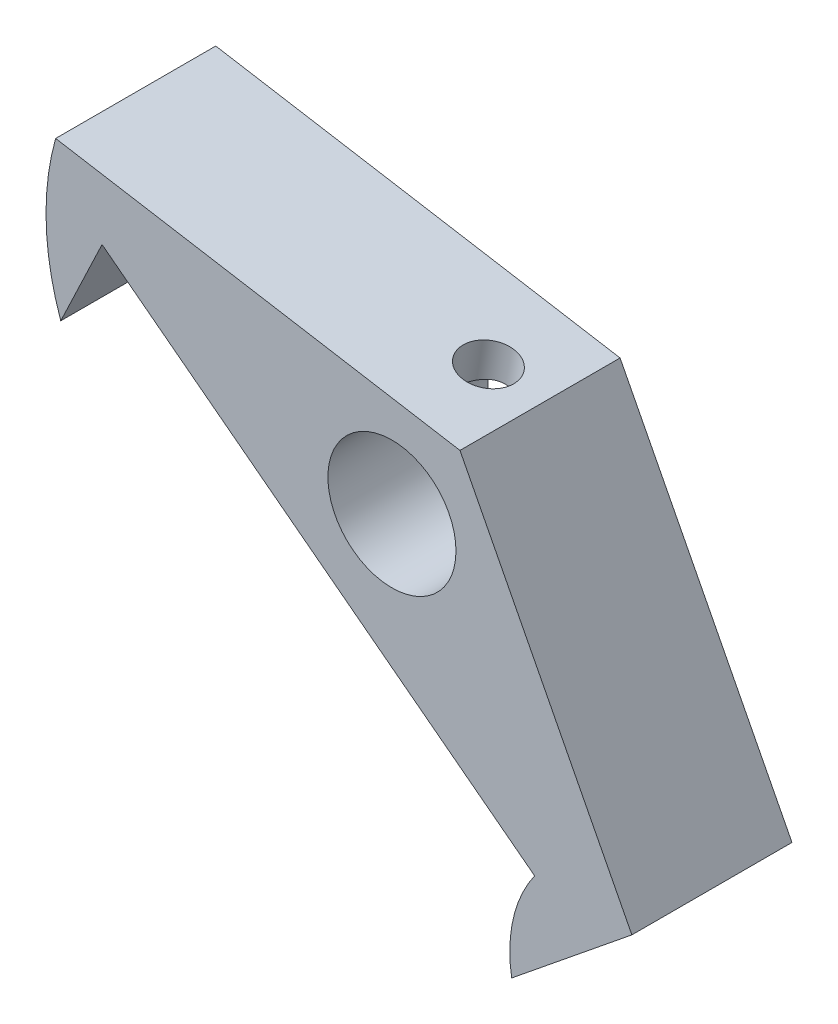
ISO-10303-21;
HEADER;
FILE_DESCRIPTION(('STEP AP214'),'2;1');
FILE_NAME('part.step','',(''),(''),'','','');
FILE_SCHEMA(('AUTOMOTIVE_DESIGN { 1 0 10303 214 1 1 1 1 }'));
ENDSEC;
DATA;
#1=APPLICATION_CONTEXT('core data for automotive mechanical design processes');
#2=APPLICATION_PROTOCOL_DEFINITION('international standard','automotive_design',2000,#1);
#3=PRODUCT_CONTEXT('',#1,'mechanical');
#4=PRODUCT('Part','Part','',(#3));
#5=PRODUCT_RELATED_PRODUCT_CATEGORY('part','',(#4));
#6=PRODUCT_DEFINITION_FORMATION('','',#4);
#7=PRODUCT_DEFINITION_CONTEXT('part definition',#1,'design');
#8=PRODUCT_DEFINITION('design','',#6,#7);
#9=PRODUCT_DEFINITION_SHAPE('','',#8);
#10=(LENGTH_UNIT() NAMED_UNIT(*) SI_UNIT(.MILLI.,.METRE.));
#11=(NAMED_UNIT(*) PLANE_ANGLE_UNIT() SI_UNIT($,.RADIAN.));
#12=(NAMED_UNIT(*) SI_UNIT($,.STERADIAN.) SOLID_ANGLE_UNIT());
#13=UNCERTAINTY_MEASURE_WITH_UNIT(LENGTH_MEASURE(1.E-05),#10,'distance_accuracy_value','');
#14=(GEOMETRIC_REPRESENTATION_CONTEXT(3) GLOBAL_UNCERTAINTY_ASSIGNED_CONTEXT((#13)) GLOBAL_UNIT_ASSIGNED_CONTEXT((#10,
#11,#12)) REPRESENTATION_CONTEXT('',''));
#15=CARTESIAN_POINT('',(0.,0.,0.));
#16=DIRECTION('',(0.,0.,1.));
#17=DIRECTION('',(1.,0.,0.));
#18=AXIS2_PLACEMENT_3D('',#15,#16,#17);
#19=CARTESIAN_POINT('',(-2.78543873261916,98.7280778215023,5.));
#20=DIRECTION('',(0.,0.,1.));
#21=DIRECTION('',(1.,0.,0.));
#22=AXIS2_PLACEMENT_3D('',#19,#20,#21);
#23=PLANE('',#22);
#24=DIRECTION('',(-0.986153532363671,0.165834889593997,0.));
#25=VECTOR('',#24,1.);
#26=CARTESIAN_POINT('',(2.12464123504047,98.7792651563676,5.));
#27=LINE('',#26,#25);
#28=CARTESIAN_POINT('',(2.12464123504047,98.7792651563676,5.));
#29=VERTEX_POINT('',#28);
#30=CARTESIAN_POINT('',(-10.5024168068803,100.902673639487,5.));
#31=VERTEX_POINT('',#30);
#32=EDGE_CURVE('E147',#29,#31,#27,.T.);
#33=ORIENTED_EDGE('',*,*,#32,.T.);
#34=CARTESIAN_POINT('',(-2.78543873261916,98.7280778215023,5.));
#35=DIRECTION('',(0.,0.,1.));
#36=DIRECTION('',(1.,0.,0.));
#37=AXIS2_PLACEMENT_3D('',#34,#35,#36);
#38=CIRCLE('',#37,8.01751941501998);
#39=CARTESIAN_POINT('',(-10.342383239066,96.0497934272108,5.));
#40=VERTEX_POINT('',#39);
#41=EDGE_CURVE('E99',#31,#40,#38,.T.);
#42=ORIENTED_EDGE('',*,*,#41,.T.);
#43=DIRECTION('',(0.429730555962983,0.902957169123622,0.));
#44=VECTOR('',#43,1.);
#45=CARTESIAN_POINT('',(-10.342383239066,96.0497934272108,5.));
#46=LINE('',#45,#44);
#47=CARTESIAN_POINT('',(-9.05319157117707,98.7586649345817,5.));
#48=VERTEX_POINT('',#47);
#49=EDGE_CURVE('E160',#40,#48,#46,.T.);
#50=ORIENTED_EDGE('',*,*,#49,.T.);
#51=DIRECTION('',(0.794671007391761,-0.607040352868706,0.));
#52=VECTOR('',#51,1.);
#53=CARTESIAN_POINT('',(-9.05319157117707,98.7586649345817,5.));
#54=LINE('',#53,#52);
#55=CARTESIAN_POINT('',(4.45662118778207,88.4386690770435,5.));
#56=VERTEX_POINT('',#55);
#57=EDGE_CURVE('E115',#48,#56,#54,.T.);
#58=ORIENTED_EDGE('',*,*,#57,.T.);
#59=CARTESIAN_POINT('',(7.86282053227756,86.012962788562,5.));
#60=DIRECTION('',(0.,0.,1.));
#61=DIRECTION('',(1.,0.,0.));
#62=AXIS2_PLACEMENT_3D('',#59,#60,#61);
#63=CIRCLE('',#62,4.18165576924022);
#64=CARTESIAN_POINT('',(3.7394519200961,85.3172068971053,5.));
#65=VERTEX_POINT('',#64);
#66=EDGE_CURVE('E109',#56,#65,#63,.T.);
#67=ORIENTED_EDGE('',*,*,#66,.T.);
#68=DIRECTION('',(0.776877331432497,0.629651976814433,0.));
#69=VECTOR('',#68,1.);
#70=CARTESIAN_POINT('',(3.7394519200961,85.3172068971053,5.));
#71=LINE('',#70,#69);
#72=CARTESIAN_POINT('',(7.49299434046541,88.3594187231144,5.));
#73=VERTEX_POINT('',#72);
#74=EDGE_CURVE('E113',#65,#73,#71,.T.);
#75=ORIENTED_EDGE('',*,*,#74,.T.);
#76=DIRECTION('',(-0.457993902099014,0.888955333883609,0.));
#77=VECTOR('',#76,1.);
#78=CARTESIAN_POINT('',(7.49299434046541,88.3594187231144,5.));
#79=LINE('',#78,#77);
#80=EDGE_CURVE('E60',#73,#29,#79,.T.);
#81=ORIENTED_EDGE('',*,*,#80,.T.);
#82=EDGE_LOOP('',(#33,#42,#50,#58,#67,#75,#81));
#83=FACE_BOUND('',#82,.T.);
#84=CARTESIAN_POINT('',(0.,95.9979166304964,5.));
#85=DIRECTION('',(0.,0.,1.));
#86=DIRECTION('',(1.,0.,0.));
#87=AXIS2_PLACEMENT_3D('',#84,#85,#86);
#88=CIRCLE('',#87,2.);
#89=CARTESIAN_POINT('',(2.,95.9979166304964,5.));
#90=VERTEX_POINT('',#89);
#91=EDGE_CURVE('E138',#90,#90,#88,.T.);
#92=ORIENTED_EDGE('',*,*,#91,.F.);
#93=EDGE_LOOP('',(#92));
#94=FACE_BOUND('',#93,.T.);
#95=ADVANCED_FACE('F37',(#83,#94),#23,.T.);
#96=CARTESIAN_POINT('',(-2.78543873261916,98.7280778215023,0.));
#97=DIRECTION('',(0.,0.,1.));
#98=DIRECTION('',(1.,0.,0.));
#99=AXIS2_PLACEMENT_3D('',#96,#97,#98);
#100=PLANE('',#99);
#101=DIRECTION('',(-0.986153532363671,0.165834889593997,0.));
#102=VECTOR('',#101,1.);
#103=CARTESIAN_POINT('',(2.12464123504047,98.7792651563676,0.));
#104=LINE('',#103,#102);
#105=CARTESIAN_POINT('',(2.12464123504047,98.7792651563676,0.));
#106=VERTEX_POINT('',#105);
#107=CARTESIAN_POINT('',(-10.5024168068803,100.902673639487,0.));
#108=VERTEX_POINT('',#107);
#109=EDGE_CURVE('E134',#106,#108,#104,.T.);
#110=ORIENTED_EDGE('',*,*,#109,.F.);
#111=DIRECTION('',(-0.457993902099014,0.888955333883609,0.));
#112=VECTOR('',#111,1.);
#113=CARTESIAN_POINT('',(7.49299434046541,88.3594187231144,0.));
#114=LINE('',#113,#112);
#115=CARTESIAN_POINT('',(7.49299434046541,88.3594187231144,0.));
#116=VERTEX_POINT('',#115);
#117=EDGE_CURVE('E91',#116,#106,#114,.T.);
#118=ORIENTED_EDGE('',*,*,#117,.F.);
#119=DIRECTION('',(0.776877331432497,0.629651976814432,0.));
#120=VECTOR('',#119,1.);
#121=CARTESIAN_POINT('',(6.07008391439359,87.2061628275486,0.));
#122=LINE('',#121,#120);
#123=CARTESIAN_POINT('',(3.7394519200961,85.3172068971053,0.));
#124=VERTEX_POINT('',#123);
#125=EDGE_CURVE('E85',#124,#116,#122,.T.);
#126=ORIENTED_EDGE('',*,*,#125,.F.);
#127=CARTESIAN_POINT('',(7.86282053227756,86.012962788562,0.));
#128=DIRECTION('',(0.,0.,1.));
#129=DIRECTION('',(1.,0.,0.));
#130=AXIS2_PLACEMENT_3D('',#127,#128,#129);
#131=CIRCLE('',#130,4.18165576924022);
#132=CARTESIAN_POINT('',(4.45662118778207,88.4386690770435,0.));
#133=VERTEX_POINT('',#132);
#134=EDGE_CURVE('E124',#133,#124,#131,.T.);
#135=ORIENTED_EDGE('',*,*,#134,.F.);
#136=DIRECTION('',(0.794671007391761,-0.607040352868706,0.));
#137=VECTOR('',#136,1.);
#138=CARTESIAN_POINT('',(-9.05319157117707,98.7586649345817,0.));
#139=LINE('',#138,#137);
#140=CARTESIAN_POINT('',(-9.05319157117707,98.7586649345817,0.));
#141=VERTEX_POINT('',#140);
#142=EDGE_CURVE('E142',#141,#133,#139,.T.);
#143=ORIENTED_EDGE('',*,*,#142,.F.);
#144=DIRECTION('',(0.429730555962983,0.902957169123622,0.));
#145=VECTOR('',#144,1.);
#146=CARTESIAN_POINT('',(-10.342383239066,96.0497934272108,0.));
#147=LINE('',#146,#145);
#148=CARTESIAN_POINT('',(-10.342383239066,96.0497934272108,0.));
#149=VERTEX_POINT('',#148);
#150=EDGE_CURVE('E140',#149,#141,#147,.T.);
#151=ORIENTED_EDGE('',*,*,#150,.F.);
#152=CARTESIAN_POINT('',(-2.78543873261916,98.7280778215023,0.));
#153=DIRECTION('',(0.,0.,1.));
#154=DIRECTION('',(1.,0.,0.));
#155=AXIS2_PLACEMENT_3D('',#152,#153,#154);
#156=CIRCLE('',#155,8.01751941501998);
#157=EDGE_CURVE('E137',#108,#149,#156,.T.);
#158=ORIENTED_EDGE('',*,*,#157,.F.);
#159=EDGE_LOOP('',(#110,#118,#126,#135,#143,#151,#158));
#160=FACE_BOUND('',#159,.T.);
#161=CARTESIAN_POINT('',(0.,95.9979166304964,0.));
#162=DIRECTION('',(0.,0.,1.));
#163=DIRECTION('',(1.,0.,0.));
#164=AXIS2_PLACEMENT_3D('',#161,#162,#163);
#165=CIRCLE('',#164,2.);
#166=CARTESIAN_POINT('',(2.,95.9979166304964,0.));
#167=VERTEX_POINT('',#166);
#168=EDGE_CURVE('E172',#167,#167,#165,.T.);
#169=ORIENTED_EDGE('',*,*,#168,.T.);
#170=EDGE_LOOP('',(#169));
#171=FACE_BOUND('',#170,.T.);
#172=ADVANCED_FACE('F164',(#160,#171),#100,.F.);
#173=CARTESIAN_POINT('',(2.12464123504047,98.7792651563676,5.));
#174=DIRECTION('',(-0.165834889593997,-0.986153532363671,0.));
#175=DIRECTION('',(0.986153532363671,-0.165834889593997,0.));
#176=AXIS2_PLACEMENT_3D('',#173,#174,#175);
#177=PLANE('',#176);
#178=CARTESIAN_POINT('',(0.513288222996372,99.0502356899404,2.5));
#179=DIRECTION('',(0.165834889593997,0.986153532363671,0.));
#180=DIRECTION('',(-0.986153532363671,0.165834889593997,0.));
#181=AXIS2_PLACEMENT_3D('',#178,#179,#180);
#182=CIRCLE('',#181,0.799999999999998);
#183=CARTESIAN_POINT('',(-0.275634602894564,99.1829036016156,2.5));
#184=VERTEX_POINT('',#183);
#185=EDGE_CURVE('E177',#184,#184,#182,.T.);
#186=ORIENTED_EDGE('',*,*,#185,.F.);
#187=EDGE_LOOP('',(#186));
#188=FACE_BOUND('',#187,.T.);
#189=ORIENTED_EDGE('',*,*,#109,.T.);
#190=DIRECTION('',(0.,0.,-1.));
#191=VECTOR('',#190,1.);
#192=CARTESIAN_POINT('',(-10.5024168068803,100.902673639487,5.));
#193=LINE('',#192,#191);
#194=EDGE_CURVE('E11',#31,#108,#193,.T.);
#195=ORIENTED_EDGE('',*,*,#194,.F.);
#196=ORIENTED_EDGE('',*,*,#32,.F.);
#197=DIRECTION('',(0.,0.,-1.));
#198=VECTOR('',#197,1.);
#199=CARTESIAN_POINT('',(2.12464123504047,98.7792651563676,5.));
#200=LINE('',#199,#198);
#201=EDGE_CURVE('E130',#29,#106,#200,.T.);
#202=ORIENTED_EDGE('',*,*,#201,.T.);
#203=EDGE_LOOP('',(#189,#195,#196,#202));
#204=FACE_BOUND('',#203,.T.);
#205=ADVANCED_FACE('F39',(#188,#204),#177,.F.);
#206=CARTESIAN_POINT('',(-2.78543873261916,98.7280778215023,5.));
#207=DIRECTION('',(0.,0.,-1.));
#208=DIRECTION('',(-1.,0.,0.));
#209=AXIS2_PLACEMENT_3D('',#206,#207,#208);
#210=CYLINDRICAL_SURFACE('',#209,8.01751941501998);
#211=ORIENTED_EDGE('',*,*,#157,.T.);
#212=DIRECTION('',(0.,0.,-1.));
#213=VECTOR('',#212,1.);
#214=CARTESIAN_POINT('',(-10.342383239066,96.0497934272108,5.));
#215=LINE('',#214,#213);
#216=EDGE_CURVE('E52',#40,#149,#215,.T.);
#217=ORIENTED_EDGE('',*,*,#216,.F.);
#218=ORIENTED_EDGE('',*,*,#41,.F.);
#219=ORIENTED_EDGE('',*,*,#194,.T.);
#220=EDGE_LOOP('',(#211,#217,#218,#219));
#221=FACE_BOUND('',#220,.T.);
#222=ADVANCED_FACE('F199',(#221),#210,.T.);
#223=CARTESIAN_POINT('',(-10.342383239066,96.0497934272108,5.));
#224=DIRECTION('',(-0.902957169123622,0.429730555962983,0.));
#225=DIRECTION('',(-0.429730555962983,-0.902957169123622,0.));
#226=AXIS2_PLACEMENT_3D('',#223,#224,#225);
#227=PLANE('',#226);
#228=ORIENTED_EDGE('',*,*,#150,.T.);
#229=DIRECTION('',(0.,0.,-1.));
#230=VECTOR('',#229,1.);
#231=CARTESIAN_POINT('',(-9.05319157117707,98.7586649345817,5.));
#232=LINE('',#231,#230);
#233=EDGE_CURVE('E151',#48,#141,#232,.T.);
#234=ORIENTED_EDGE('',*,*,#233,.F.);
#235=ORIENTED_EDGE('',*,*,#49,.F.);
#236=ORIENTED_EDGE('',*,*,#216,.T.);
#237=EDGE_LOOP('',(#228,#234,#235,#236));
#238=FACE_BOUND('',#237,.T.);
#239=ADVANCED_FACE('F158',(#238),#227,.F.);
#240=CARTESIAN_POINT('',(-9.05319157117707,98.7586649345817,5.));
#241=DIRECTION('',(0.607040352868706,0.794671007391761,0.));
#242=DIRECTION('',(-0.794671007391761,0.607040352868706,0.));
#243=AXIS2_PLACEMENT_3D('',#240,#241,#242);
#244=PLANE('',#243);
#245=ORIENTED_EDGE('',*,*,#142,.T.);
#246=DIRECTION('',(0.,0.,-1.));
#247=VECTOR('',#246,1.);
#248=CARTESIAN_POINT('',(4.45662118778207,88.4386690770435,5.));
#249=LINE('',#248,#247);
#250=EDGE_CURVE('E125',#56,#133,#249,.T.);
#251=ORIENTED_EDGE('',*,*,#250,.F.);
#252=ORIENTED_EDGE('',*,*,#57,.F.);
#253=ORIENTED_EDGE('',*,*,#233,.T.);
#254=EDGE_LOOP('',(#245,#251,#252,#253));
#255=FACE_BOUND('',#254,.T.);
#256=ADVANCED_FACE('F167',(#255),#244,.F.);
#257=CARTESIAN_POINT('',(7.86282053227756,86.012962788562,5.));
#258=DIRECTION('',(0.,0.,-1.));
#259=DIRECTION('',(-1.,0.,0.));
#260=AXIS2_PLACEMENT_3D('',#257,#258,#259);
#261=CYLINDRICAL_SURFACE('',#260,4.18165576924022);
#262=ORIENTED_EDGE('',*,*,#134,.T.);
#263=DIRECTION('',(0.,0.,-1.));
#264=VECTOR('',#263,1.);
#265=CARTESIAN_POINT('',(3.7394519200961,85.3172068971053,5.));
#266=LINE('',#265,#264);
#267=EDGE_CURVE('E121',#65,#124,#266,.T.);
#268=ORIENTED_EDGE('',*,*,#267,.F.);
#269=ORIENTED_EDGE('',*,*,#66,.F.);
#270=ORIENTED_EDGE('',*,*,#250,.T.);
#271=EDGE_LOOP('',(#262,#268,#269,#270));
#272=FACE_BOUND('',#271,.T.);
#273=ADVANCED_FACE('F122',(#272),#261,.T.);
#274=CARTESIAN_POINT('',(6.07008391439359,87.2061628275486,5.));
#275=DIRECTION('',(-0.629651976814432,0.776877331432497,0.));
#276=DIRECTION('',(-0.776877331432497,-0.629651976814432,0.));
#277=AXIS2_PLACEMENT_3D('',#274,#275,#276);
#278=PLANE('',#277);
#279=ORIENTED_EDGE('',*,*,#125,.T.);
#280=DIRECTION('',(0.,0.,-1.));
#281=VECTOR('',#280,1.);
#282=CARTESIAN_POINT('',(7.49299434046541,88.3594187231144,5.));
#283=LINE('',#282,#281);
#284=EDGE_CURVE('E126',#73,#116,#283,.T.);
#285=ORIENTED_EDGE('',*,*,#284,.F.);
#286=ORIENTED_EDGE('',*,*,#74,.F.);
#287=ORIENTED_EDGE('',*,*,#267,.T.);
#288=EDGE_LOOP('',(#279,#285,#286,#287));
#289=FACE_BOUND('',#288,.T.);
#290=ADVANCED_FACE('F128',(#289),#278,.F.);
#291=CARTESIAN_POINT('',(7.49299434046541,88.3594187231144,5.));
#292=DIRECTION('',(-0.888955333883609,-0.457993902099014,0.));
#293=DIRECTION('',(0.457993902099014,-0.888955333883609,0.));
#294=AXIS2_PLACEMENT_3D('',#291,#292,#293);
#295=PLANE('',#294);
#296=ORIENTED_EDGE('',*,*,#117,.T.);
#297=ORIENTED_EDGE('',*,*,#201,.F.);
#298=ORIENTED_EDGE('',*,*,#80,.F.);
#299=ORIENTED_EDGE('',*,*,#284,.T.);
#300=EDGE_LOOP('',(#296,#297,#298,#299));
#301=FACE_BOUND('',#300,.T.);
#302=ADVANCED_FACE('F189',(#301),#295,.F.);
#303=CARTESIAN_POINT('',(0.,95.9979166304964,5.));
#304=DIRECTION('',(0.,0.,-1.));
#305=DIRECTION('',(-1.,0.,0.));
#306=AXIS2_PLACEMENT_3D('',#303,#304,#305);
#307=CYLINDRICAL_SURFACE('',#306,2.);
#308=CARTESIAN_POINT('',(-0.484942452119277,97.9382338257335,2.5));
#309=CARTESIAN_POINT('',(-0.484937101015815,97.9382373152953,2.45714420076004));
#310=CARTESIAN_POINT('',(-0.481273590471203,97.9391623897535,2.41422778611812));
#311=CARTESIAN_POINT('',(-0.466778444418085,97.9426967743646,2.32962606684917));
#312=CARTESIAN_POINT('',(-0.455928492143115,97.9453103878374,2.2879441931678));
#313=CARTESIAN_POINT('',(-0.427605461160966,97.9517236842403,2.20717882321198));
#314=CARTESIAN_POINT('',(-0.410157336906307,97.955518888923,2.1680861810559));
#315=CARTESIAN_POINT('',(-0.369296734697393,97.9636358415414,2.09324597965615));
#316=CARTESIAN_POINT('',(-0.345885559062225,97.9679574743987,2.05749769233966));
#317=CARTESIAN_POINT('',(-0.29244084215762,97.9766149679644,1.98829583910342));
#318=CARTESIAN_POINT('',(-0.262126821557162,97.9809399429621,1.95505743082821));
#319=CARTESIAN_POINT('',(-0.196493770332096,97.9885147333284,1.89378840107385));
#320=CARTESIAN_POINT('',(-0.161172998248759,97.991764173285,1.86575959948406));
#321=CARTESIAN_POINT('',(-0.0849454632725233,97.9964903702535,1.81463744120692));
#322=CARTESIAN_POINT('',(-0.0438733536632644,97.997892174637,1.79178227941174));
#323=CARTESIAN_POINT('',(0.041518475011953,97.9979403936108,1.75326257264408));
#324=CARTESIAN_POINT('',(0.0858368640382818,97.9965879306373,1.73759510168722));
#325=CARTESIAN_POINT('',(0.174112254721723,97.9907903048257,1.71466340542504));
#326=CARTESIAN_POINT('',(0.217982877315844,97.9864980393244,1.70702907436439));
#327=CARTESIAN_POINT('',(0.305978004228626,97.9748698636391,1.69918860573492));
#328=CARTESIAN_POINT('',(0.350102407711515,97.9675350896955,1.69897969762606));
#329=CARTESIAN_POINT('',(0.434726944647094,97.9505486428796,1.70579310791));
#330=CARTESIAN_POINT('',(0.475291438122824,97.94105025121,1.71240990909877));
#331=CARTESIAN_POINT('',(0.554293849161638,97.920006694965,1.7319971505243));
#332=CARTESIAN_POINT('',(0.592731610456579,97.9084613802471,1.74496805696016));
#333=CARTESIAN_POINT('',(0.667138900046228,97.8837815906312,1.77705459315052));
#334=CARTESIAN_POINT('',(0.703062497750853,97.8706257874048,1.79625988592621));
#335=CARTESIAN_POINT('',(0.771088527831879,97.8436585967356,1.84018600276761));
#336=CARTESIAN_POINT('',(0.803189644736489,97.8298469858766,1.86490871723905));
#337=CARTESIAN_POINT('',(0.864986879088615,97.8015318757375,1.92105965437864));
#338=CARTESIAN_POINT('',(0.894386723693511,97.7870424862585,1.95282155703354));
#339=CARTESIAN_POINT('',(0.947679583463272,97.7593951911435,2.02119622872839));
#340=CARTESIAN_POINT('',(0.971570796288542,97.7462377220791,2.05781057926167));
#341=CARTESIAN_POINT('',(1.01391967793167,97.7220338963394,2.13616760896358));
#342=CARTESIAN_POINT('',(1.03220480613292,97.7110576691061,2.17802593219353));
#343=CARTESIAN_POINT('',(1.06185144382586,97.6928437286238,2.26488619618481));
#344=CARTESIAN_POINT('',(1.07321745026197,97.6856035876477,2.30988607390834));
#345=CARTESIAN_POINT('',(1.08813698672621,97.676020401688,2.39881431097442));
#346=CARTESIAN_POINT('',(1.09212537985251,97.6734052027894,2.44264017884807));
#347=CARTESIAN_POINT('',(1.0934739281024,97.6725259171553,2.53043088310718));
#348=CARTESIAN_POINT('',(1.09083609323486,97.6742605109476,2.57439567331114));
#349=CARTESIAN_POINT('',(1.07938143471711,97.6816555432321,2.65858357398195));
#350=CARTESIAN_POINT('',(1.070925095781,97.6870867561422,2.6988771749598));
#351=CARTESIAN_POINT('',(1.04848743923037,97.701104166985,2.7773153619144));
#352=CARTESIAN_POINT('',(1.03450489655478,97.7096910644472,2.81545946924292));
#353=CARTESIAN_POINT('',(1.00069717377051,97.7296800588718,2.8902409431182));
#354=CARTESIAN_POINT('',(0.980658050484053,97.7411821998085,2.92675447547778));
#355=CARTESIAN_POINT('',(0.935407354103611,97.7658749738178,2.99579319497667));
#356=CARTESIAN_POINT('',(0.910193674403336,97.7790662937445,3.02831674911824));
#357=CARTESIAN_POINT('',(0.852990377028013,97.8071968696595,3.09094936343969));
#358=CARTESIAN_POINT('',(0.820637821007793,97.8221932645671,3.12070262611641));
#359=CARTESIAN_POINT('',(0.751090203275649,97.8519101085228,3.17407083064414));
#360=CARTESIAN_POINT('',(0.71389494454523,97.866630546316,3.19768552263889));
#361=CARTESIAN_POINT('',(0.635469265209559,97.8947327212742,3.23801905058449));
#362=CARTESIAN_POINT('',(0.59423981370543,97.9081147783932,3.25473953766631));
#363=CARTESIAN_POINT('',(0.508843148873325,97.932612237062,3.28061954096305));
#364=CARTESIAN_POINT('',(0.464677543982371,97.9437288662725,3.28978316057602));
#365=CARTESIAN_POINT('',(0.377735460230194,97.962391989476,3.29980188065015));
#366=CARTESIAN_POINT('',(0.335056350480149,97.9701240913653,3.30116005138506));
#367=CARTESIAN_POINT('',(0.249636874742033,97.9827451604531,3.29685780828636));
#368=CARTESIAN_POINT('',(0.206896519004865,97.9876345578642,3.29119845688575));
#369=CARTESIAN_POINT('',(0.123949928243055,97.9944929912507,3.27338128465661));
#370=CARTESIAN_POINT('',(0.0837061796748586,97.996547120364,3.26142842156978));
#371=CARTESIAN_POINT('',(0.00543850188784729,97.9982926705637,3.23157887817527));
#372=CARTESIAN_POINT('',(-0.0325850163862053,97.9979836556415,3.21368110159186));
#373=CARTESIAN_POINT('',(-0.107110247921604,97.9954098492829,3.17155872060426));
#374=CARTESIAN_POINT('',(-0.14347046029005,97.9930592348526,3.14708948204597));
#375=CARTESIAN_POINT('',(-0.211903533377232,97.9869564173403,3.09288459232843));
#376=CARTESIAN_POINT('',(-0.243974609894574,97.983203633429,3.06314676141595));
#377=CARTESIAN_POINT('',(-0.304865932623612,97.9747979157488,2.99707391018998));
#378=CARTESIAN_POINT('',(-0.333362026515478,97.9701036393712,2.96044445063956));
#379=CARTESIAN_POINT('',(-0.383716049494428,97.9609296209424,2.88282314502849));
#380=CARTESIAN_POINT('',(-0.405573198116587,97.9564499041667,2.84183078683606));
#381=CARTESIAN_POINT('',(-0.440140139765651,97.948957706934,2.76038511926077));
#382=CARTESIAN_POINT('',(-0.453495061554534,97.9458495992165,2.72021390609953));
#383=CARTESIAN_POINT('',(-0.473392324963386,97.9411120006613,2.63820583214786));
#384=CARTESIAN_POINT('',(-0.479953649578468,97.9394783913589,2.59637395361322));
#385=CARTESIAN_POINT('',(-0.48429229098884,97.9383958062402,2.53624897506483));
#386=CARTESIAN_POINT('',(-0.484944715874346,97.9382323494934,2.51812991160096));
#387=CARTESIAN_POINT('',(-0.484942452119277,97.9382338257335,2.5));
#388=B_SPLINE_CURVE_WITH_KNOTS('',3,(#308,#309,#310,#311,#312,#313,#314,#315,#316,#317,#318,
#319,#320,#321,#322,#323,#324,#325,#326,#327,#328,#329,#330,#331,#332,#333,#334,#335,#336,#337,
#338,#339,#340,#341,#342,#343,#344,#345,#346,#347,#348,#349,#350,#351,#352,#353,#354,#355,#356,
#357,#358,#359,#360,#361,#362,#363,#364,#365,#366,#367,#368,#369,#370,#371,#372,#373,#374,#375,
#376,#377,#378,#379,#380,#381,#382,#383,#384,#385,#386,#387),.UNSPECIFIED.,.T.,.F.,(4,2,2,2,2,2,
2,2,2,2,2,2,2,2,2,2,2,2,2,2,2,2,2,2,2,2,2,2,2,2,2,2,2,2,2,2,2,2,2,4),(0.,0.128511059507062,
0.257350934328898,0.385708329317356,0.514037715295445,0.649022473137699,0.784054297393367,
0.924410676365712,1.06470986787792,1.19821673154873,1.33167378122269,1.45763457932121,
1.58360462051623,1.71147320093959,1.83938565976013,1.97569617632543,2.11205122850851,
2.2522578348583,2.39237321917644,2.52392859007372,2.6554440596078,2.77946899231662,
2.90352143458259,3.03260461858684,3.16174045807944,3.30041493696396,3.43909505938703,
3.57774194922728,3.71631350379258,3.84584415899985,3.97535520602644,4.10088797774944,
4.22644391129038,4.35754820453573,4.48870686623286,4.62798501311849,4.76727952701279,
4.89406664325234,5.02049852085301,5.07486442208293),.UNSPECIFIED.);
#389=CARTESIAN_POINT('',(-0.484942452119277,97.9382338257335,2.5));
#390=VERTEX_POINT('',#389);
#391=EDGE_CURVE('E41',#390,#390,#388,.T.);
#392=ORIENTED_EDGE('',*,*,#391,.F.);
#393=EDGE_LOOP('',(#392));
#394=FACE_BOUND('',#393,.T.);
#395=ORIENTED_EDGE('',*,*,#91,.T.);
#396=EDGE_LOOP('',(#395));
#397=FACE_BOUND('',#396,.T.);
#398=ORIENTED_EDGE('',*,*,#168,.F.);
#399=EDGE_LOOP('',(#398));
#400=FACE_BOUND('',#399,.T.);
#401=ADVANCED_FACE('F186',(#394,#397,#400),#307,.F.);
#402=CARTESIAN_POINT('',(0.513288222996372,99.0502356899404,2.5));
#403=DIRECTION('',(0.165834889593997,0.986153532363671,0.));
#404=DIRECTION('',(-0.986153532363671,0.165834889593997,0.));
#405=AXIS2_PLACEMENT_3D('',#402,#403,#404);
#406=CYLINDRICAL_SURFACE('',#405,0.799999999999999);
#407=ORIENTED_EDGE('',*,*,#391,.T.);
#408=EDGE_LOOP('',(#407));
#409=FACE_BOUND('',#408,.T.);
#410=ORIENTED_EDGE('',*,*,#185,.T.);
#411=EDGE_LOOP('',(#410));
#412=FACE_BOUND('',#411,.T.);
#413=ADVANCED_FACE('F184',(#409,#412),#406,.F.);
#414=CLOSED_SHELL('',(#95,#172,#205,#222,#239,#256,#273,#290,#302,#401,#413));
#415=MANIFOLD_SOLID_BREP('B2',#414);
#416=ADVANCED_BREP_SHAPE_REPRESENTATION('',(#18,#415),#14);
#417=SHAPE_DEFINITION_REPRESENTATION(#9,#416);
ENDSEC;
END-ISO-10303-21;
